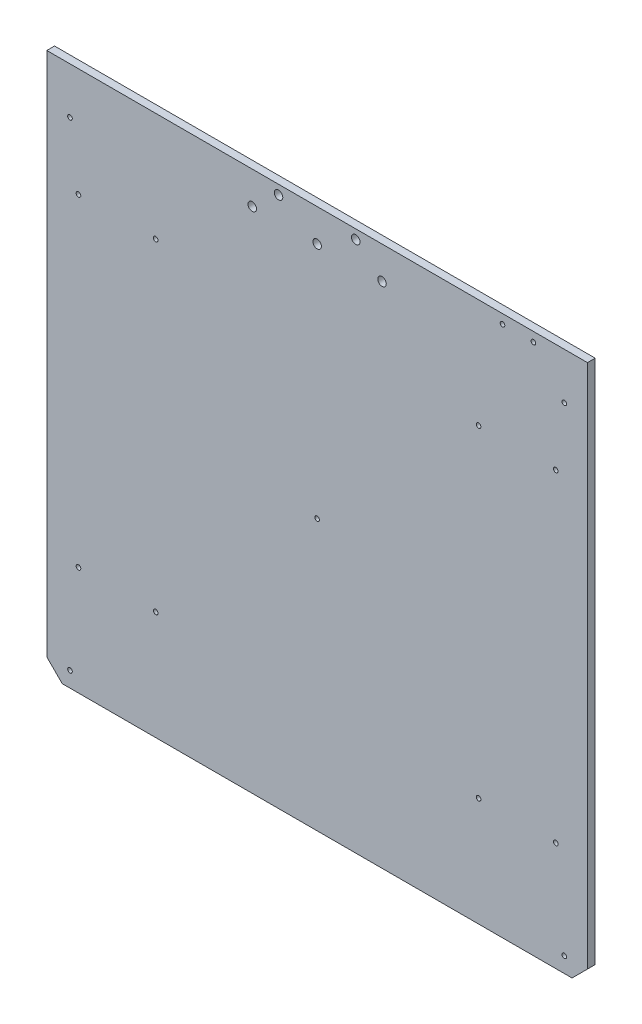
ISO-10303-21;
HEADER;
FILE_DESCRIPTION(('STEP AP214'),'2;1');
FILE_NAME('part.step','',(''),(''),'','','');
FILE_SCHEMA(('AUTOMOTIVE_DESIGN { 1 0 10303 214 1 1 1 1 }'));
ENDSEC;
DATA;
#1=APPLICATION_CONTEXT('core data for automotive mechanical design processes');
#2=APPLICATION_PROTOCOL_DEFINITION('international standard','automotive_design',2000,#1);
#3=PRODUCT_CONTEXT('',#1,'mechanical');
#4=PRODUCT('Part','Part','',(#3));
#5=PRODUCT_RELATED_PRODUCT_CATEGORY('part','',(#4));
#6=PRODUCT_DEFINITION_FORMATION('','',#4);
#7=PRODUCT_DEFINITION_CONTEXT('part definition',#1,'design');
#8=PRODUCT_DEFINITION('design','',#6,#7);
#9=PRODUCT_DEFINITION_SHAPE('','',#8);
#10=(LENGTH_UNIT() NAMED_UNIT(*) SI_UNIT(.MILLI.,.METRE.));
#11=(NAMED_UNIT(*) PLANE_ANGLE_UNIT() SI_UNIT($,.RADIAN.));
#12=(NAMED_UNIT(*) SI_UNIT($,.STERADIAN.) SOLID_ANGLE_UNIT());
#13=UNCERTAINTY_MEASURE_WITH_UNIT(LENGTH_MEASURE(1.E-05),#10,'distance_accuracy_value','');
#14=(GEOMETRIC_REPRESENTATION_CONTEXT(3) GLOBAL_UNCERTAINTY_ASSIGNED_CONTEXT((#13)) GLOBAL_UNIT_ASSIGNED_CONTEXT((#10,
#11,#12)) REPRESENTATION_CONTEXT('',''));
#15=CARTESIAN_POINT('',(0.,0.,0.));
#16=DIRECTION('',(0.,0.,1.));
#17=DIRECTION('',(1.,0.,0.));
#18=AXIS2_PLACEMENT_3D('',#15,#16,#17);
#19=CARTESIAN_POINT('',(350.,10.,-5.));
#20=DIRECTION('',(1.,0.,0.));
#21=DIRECTION('',(0.,0.,-1.));
#22=AXIS2_PLACEMENT_3D('',#19,#20,#21);
#23=PLANE('',#22);
#24=DIRECTION('',(0.,1.,0.));
#25=VECTOR('',#24,1.);
#26=CARTESIAN_POINT('',(350.,10.,0.));
#27=LINE('',#26,#25);
#28=CARTESIAN_POINT('',(350.,10.,0.));
#29=VERTEX_POINT('',#28);
#30=CARTESIAN_POINT('',(350.,350.,0.));
#31=VERTEX_POINT('',#30);
#32=EDGE_CURVE('E118',#29,#31,#27,.T.);
#33=ORIENTED_EDGE('',*,*,#32,.F.);
#34=DIRECTION('',(0.,0.,1.));
#35=VECTOR('',#34,1.);
#36=CARTESIAN_POINT('',(350.,10.,-5.));
#37=LINE('',#36,#35);
#38=CARTESIAN_POINT('',(350.,10.,-5.));
#39=VERTEX_POINT('',#38);
#40=EDGE_CURVE('E11',#39,#29,#37,.T.);
#41=ORIENTED_EDGE('',*,*,#40,.F.);
#42=DIRECTION('',(0.,1.,0.));
#43=VECTOR('',#42,1.);
#44=CARTESIAN_POINT('',(350.,10.,-5.));
#45=LINE('',#44,#43);
#46=CARTESIAN_POINT('',(350.,350.,-5.));
#47=VERTEX_POINT('',#46);
#48=EDGE_CURVE('E133',#39,#47,#45,.T.);
#49=ORIENTED_EDGE('',*,*,#48,.T.);
#50=DIRECTION('',(0.,0.,1.));
#51=VECTOR('',#50,1.);
#52=CARTESIAN_POINT('',(350.,350.,-5.));
#53=LINE('',#52,#51);
#54=EDGE_CURVE('E36',#47,#31,#53,.T.);
#55=ORIENTED_EDGE('',*,*,#54,.T.);
#56=EDGE_LOOP('',(#33,#41,#49,#55));
#57=FACE_BOUND('',#56,.T.);
#58=ADVANCED_FACE('F33',(#57),#23,.T.);
#59=CARTESIAN_POINT('',(340.,0.,-5.));
#60=DIRECTION('',(0.707106781186547,-0.707106781186548,0.));
#61=DIRECTION('',(0.707106781186548,0.707106781186547,0.));
#62=AXIS2_PLACEMENT_3D('',#59,#60,#61);
#63=PLANE('',#62);
#64=DIRECTION('',(0.707106781186548,0.707106781186547,0.));
#65=VECTOR('',#64,1.);
#66=CARTESIAN_POINT('',(340.,0.,0.));
#67=LINE('',#66,#65);
#68=CARTESIAN_POINT('',(340.,0.,0.));
#69=VERTEX_POINT('',#68);
#70=EDGE_CURVE('E131',#69,#29,#67,.T.);
#71=ORIENTED_EDGE('',*,*,#70,.F.);
#72=DIRECTION('',(0.,0.,1.));
#73=VECTOR('',#72,1.);
#74=CARTESIAN_POINT('',(340.,0.,-5.));
#75=LINE('',#74,#73);
#76=CARTESIAN_POINT('',(340.,0.,-5.));
#77=VERTEX_POINT('',#76);
#78=EDGE_CURVE('E42',#77,#69,#75,.T.);
#79=ORIENTED_EDGE('',*,*,#78,.F.);
#80=DIRECTION('',(0.707106781186548,0.707106781186547,0.));
#81=VECTOR('',#80,1.);
#82=CARTESIAN_POINT('',(340.,0.,-5.));
#83=LINE('',#82,#81);
#84=EDGE_CURVE('E108',#77,#39,#83,.T.);
#85=ORIENTED_EDGE('',*,*,#84,.T.);
#86=ORIENTED_EDGE('',*,*,#40,.T.);
#87=EDGE_LOOP('',(#71,#79,#85,#86));
#88=FACE_BOUND('',#87,.T.);
#89=ADVANCED_FACE('F141',(#88),#63,.T.);
#90=CARTESIAN_POINT('',(10.,0.,-5.));
#91=DIRECTION('',(0.,-1.,0.));
#92=DIRECTION('',(0.,0.,-1.));
#93=AXIS2_PLACEMENT_3D('',#90,#91,#92);
#94=PLANE('',#93);
#95=DIRECTION('',(1.,0.,0.));
#96=VECTOR('',#95,1.);
#97=CARTESIAN_POINT('',(10.,0.,0.));
#98=LINE('',#97,#96);
#99=CARTESIAN_POINT('',(10.,0.,0.));
#100=VERTEX_POINT('',#99);
#101=EDGE_CURVE('E95',#100,#69,#98,.T.);
#102=ORIENTED_EDGE('',*,*,#101,.F.);
#103=DIRECTION('',(0.,0.,1.));
#104=VECTOR('',#103,1.);
#105=CARTESIAN_POINT('',(10.,0.,-5.));
#106=LINE('',#105,#104);
#107=CARTESIAN_POINT('',(10.,0.,-5.));
#108=VERTEX_POINT('',#107);
#109=EDGE_CURVE('E90',#108,#100,#106,.T.);
#110=ORIENTED_EDGE('',*,*,#109,.F.);
#111=DIRECTION('',(1.,0.,0.));
#112=VECTOR('',#111,1.);
#113=CARTESIAN_POINT('',(10.,0.,-5.));
#114=LINE('',#113,#112);
#115=EDGE_CURVE('E93',#108,#77,#114,.T.);
#116=ORIENTED_EDGE('',*,*,#115,.T.);
#117=ORIENTED_EDGE('',*,*,#78,.T.);
#118=EDGE_LOOP('',(#102,#110,#116,#117));
#119=FACE_BOUND('',#118,.T.);
#120=ADVANCED_FACE('F92',(#119),#94,.T.);
#121=CARTESIAN_POINT('',(10.,0.,-5.));
#122=DIRECTION('',(-0.707106781186548,-0.707106781186548,0.));
#123=DIRECTION('',(0.707106781186548,-0.707106781186548,0.));
#124=AXIS2_PLACEMENT_3D('',#121,#122,#123);
#125=PLANE('',#124);
#126=DIRECTION('',(0.707106781186548,-0.707106781186548,0.));
#127=VECTOR('',#126,1.);
#128=CARTESIAN_POINT('',(10.,0.,0.));
#129=LINE('',#128,#127);
#130=CARTESIAN_POINT('',(0.,10.,0.));
#131=VERTEX_POINT('',#130);
#132=EDGE_CURVE('E128',#131,#100,#129,.T.);
#133=ORIENTED_EDGE('',*,*,#132,.F.);
#134=DIRECTION('',(0.,0.,1.));
#135=VECTOR('',#134,1.);
#136=CARTESIAN_POINT('',(0.,10.,-5.));
#137=LINE('',#136,#135);
#138=CARTESIAN_POINT('',(0.,10.,-5.));
#139=VERTEX_POINT('',#138);
#140=EDGE_CURVE('E100',#139,#131,#137,.T.);
#141=ORIENTED_EDGE('',*,*,#140,.F.);
#142=DIRECTION('',(0.707106781186548,-0.707106781186548,0.));
#143=VECTOR('',#142,1.);
#144=CARTESIAN_POINT('',(10.,0.,-5.));
#145=LINE('',#144,#143);
#146=EDGE_CURVE('E106',#139,#108,#145,.T.);
#147=ORIENTED_EDGE('',*,*,#146,.T.);
#148=ORIENTED_EDGE('',*,*,#109,.T.);
#149=EDGE_LOOP('',(#133,#141,#147,#148));
#150=FACE_BOUND('',#149,.T.);
#151=ADVANCED_FACE('F110',(#150),#125,.T.);
#152=CARTESIAN_POINT('',(0.,10.,-5.));
#153=DIRECTION('',(-1.,0.,0.));
#154=DIRECTION('',(0.,0.,1.));
#155=AXIS2_PLACEMENT_3D('',#152,#153,#154);
#156=PLANE('',#155);
#157=DIRECTION('',(0.,-1.,0.));
#158=VECTOR('',#157,1.);
#159=CARTESIAN_POINT('',(0.,10.,0.));
#160=LINE('',#159,#158);
#161=CARTESIAN_POINT('',(0.,350.,0.));
#162=VERTEX_POINT('',#161);
#163=EDGE_CURVE('E125',#162,#131,#160,.T.);
#164=ORIENTED_EDGE('',*,*,#163,.F.);
#165=DIRECTION('',(0.,0.,1.));
#166=VECTOR('',#165,1.);
#167=CARTESIAN_POINT('',(0.,350.,-5.));
#168=LINE('',#167,#166);
#169=CARTESIAN_POINT('',(0.,350.,-5.));
#170=VERTEX_POINT('',#169);
#171=EDGE_CURVE('E136',#170,#162,#168,.T.);
#172=ORIENTED_EDGE('',*,*,#171,.F.);
#173=DIRECTION('',(0.,-1.,0.));
#174=VECTOR('',#173,1.);
#175=CARTESIAN_POINT('',(0.,10.,-5.));
#176=LINE('',#175,#174);
#177=EDGE_CURVE('E111',#170,#139,#176,.T.);
#178=ORIENTED_EDGE('',*,*,#177,.T.);
#179=ORIENTED_EDGE('',*,*,#140,.T.);
#180=EDGE_LOOP('',(#164,#172,#178,#179));
#181=FACE_BOUND('',#180,.T.);
#182=ADVANCED_FACE('F154',(#181),#156,.T.);
#183=CARTESIAN_POINT('',(0.,350.,-5.));
#184=DIRECTION('',(0.,1.,0.));
#185=DIRECTION('',(0.,0.,1.));
#186=AXIS2_PLACEMENT_3D('',#183,#184,#185);
#187=PLANE('',#186);
#188=DIRECTION('',(-1.,0.,0.));
#189=VECTOR('',#188,1.);
#190=CARTESIAN_POINT('',(0.,350.,0.));
#191=LINE('',#190,#189);
#192=EDGE_CURVE('E121',#31,#162,#191,.T.);
#193=ORIENTED_EDGE('',*,*,#192,.F.);
#194=ORIENTED_EDGE('',*,*,#54,.F.);
#195=DIRECTION('',(-1.,0.,0.));
#196=VECTOR('',#195,1.);
#197=CARTESIAN_POINT('',(0.,350.,-5.));
#198=LINE('',#197,#196);
#199=EDGE_CURVE('E113',#47,#170,#198,.T.);
#200=ORIENTED_EDGE('',*,*,#199,.T.);
#201=ORIENTED_EDGE('',*,*,#171,.T.);
#202=EDGE_LOOP('',(#193,#194,#200,#201));
#203=FACE_BOUND('',#202,.T.);
#204=ADVANCED_FACE('F138',(#203),#187,.T.);
#205=CARTESIAN_POINT('',(0.,0.,-5.));
#206=DIRECTION('',(0.,0.,-1.));
#207=DIRECTION('',(-1.,0.,0.));
#208=AXIS2_PLACEMENT_3D('',#205,#206,#207);
#209=PLANE('',#208);
#210=CARTESIAN_POINT('',(315.,344.,-5.));
#211=DIRECTION('',(0.,0.,1.));
#212=DIRECTION('',(1.,0.,0.));
#213=AXIS2_PLACEMENT_3D('',#210,#211,#212);
#214=CIRCLE('',#213,1.49999999999997);
#215=CARTESIAN_POINT('',(316.5,344.,-5.));
#216=VERTEX_POINT('',#215);
#217=EDGE_CURVE('E252',#216,#216,#214,.T.);
#218=ORIENTED_EDGE('',*,*,#217,.T.);
#219=EDGE_LOOP('',(#218));
#220=FACE_BOUND('',#219,.T.);
#221=CARTESIAN_POINT('',(295.,344.,-5.));
#222=DIRECTION('',(0.,0.,1.));
#223=DIRECTION('',(1.,0.,0.));
#224=AXIS2_PLACEMENT_3D('',#221,#222,#223);
#225=CIRCLE('',#224,1.49999999999997);
#226=CARTESIAN_POINT('',(296.5,344.,-5.));
#227=VERTEX_POINT('',#226);
#228=EDGE_CURVE('E260',#227,#227,#225,.T.);
#229=ORIENTED_EDGE('',*,*,#228,.T.);
#230=EDGE_LOOP('',(#229));
#231=FACE_BOUND('',#230,.T.);
#232=CARTESIAN_POINT('',(335.000000000004,319.999999999997,-5.));
#233=DIRECTION('',(0.,0.,1.));
#234=DIRECTION('',(1.,0.,0.));
#235=AXIS2_PLACEMENT_3D('',#232,#233,#234);
#236=CIRCLE('',#235,1.49999999999997);
#237=CARTESIAN_POINT('',(336.500000000004,319.999999999997,-5.));
#238=VERTEX_POINT('',#237);
#239=EDGE_CURVE('E266',#238,#238,#236,.T.);
#240=ORIENTED_EDGE('',*,*,#239,.T.);
#241=EDGE_LOOP('',(#240));
#242=FACE_BOUND('',#241,.T.);
#243=CARTESIAN_POINT('',(329.5,279.5,-5.));
#244=DIRECTION('',(0.,0.,1.));
#245=DIRECTION('',(1.,0.,0.));
#246=AXIS2_PLACEMENT_3D('',#243,#244,#245);
#247=CIRCLE('',#246,1.49999999999997);
#248=CARTESIAN_POINT('',(331.,279.5,-5.));
#249=VERTEX_POINT('',#248);
#250=EDGE_CURVE('E272',#249,#249,#247,.T.);
#251=ORIENTED_EDGE('',*,*,#250,.T.);
#252=EDGE_LOOP('',(#251));
#253=FACE_BOUND('',#252,.T.);
#254=CARTESIAN_POINT('',(279.5,279.5,-5.));
#255=DIRECTION('',(0.,0.,1.));
#256=DIRECTION('',(1.,0.,0.));
#257=AXIS2_PLACEMENT_3D('',#254,#255,#256);
#258=CIRCLE('',#257,1.49999999999997);
#259=CARTESIAN_POINT('',(281.,279.5,-5.));
#260=VERTEX_POINT('',#259);
#261=EDGE_CURVE('E278',#260,#260,#258,.T.);
#262=ORIENTED_EDGE('',*,*,#261,.T.);
#263=EDGE_LOOP('',(#262));
#264=FACE_BOUND('',#263,.T.);
#265=CARTESIAN_POINT('',(15.,10.,-5.));
#266=DIRECTION('',(0.,0.,1.));
#267=DIRECTION('',(1.,0.,0.));
#268=AXIS2_PLACEMENT_3D('',#265,#266,#267);
#269=CIRCLE('',#268,1.49999999999997);
#270=CARTESIAN_POINT('',(16.5,10.,-5.));
#271=VERTEX_POINT('',#270);
#272=EDGE_CURVE('E284',#271,#271,#269,.T.);
#273=ORIENTED_EDGE('',*,*,#272,.T.);
#274=EDGE_LOOP('',(#273));
#275=FACE_BOUND('',#274,.T.);
#276=CARTESIAN_POINT('',(335.,10.,-5.));
#277=DIRECTION('',(0.,0.,1.));
#278=DIRECTION('',(1.,0.,0.));
#279=AXIS2_PLACEMENT_3D('',#276,#277,#278);
#280=CIRCLE('',#279,1.49999999999997);
#281=CARTESIAN_POINT('',(336.5,10.,-5.));
#282=VERTEX_POINT('',#281);
#283=EDGE_CURVE('E290',#282,#282,#280,.T.);
#284=ORIENTED_EDGE('',*,*,#283,.T.);
#285=EDGE_LOOP('',(#284));
#286=FACE_BOUND('',#285,.T.);
#287=CARTESIAN_POINT('',(329.5,70.5,-5.));
#288=DIRECTION('',(0.,0.,1.));
#289=DIRECTION('',(1.,0.,0.));
#290=AXIS2_PLACEMENT_3D('',#287,#288,#289);
#291=CIRCLE('',#290,1.49999999999997);
#292=CARTESIAN_POINT('',(331.,70.5,-5.));
#293=VERTEX_POINT('',#292);
#294=EDGE_CURVE('E296',#293,#293,#291,.T.);
#295=ORIENTED_EDGE('',*,*,#294,.T.);
#296=EDGE_LOOP('',(#295));
#297=FACE_BOUND('',#296,.T.);
#298=CARTESIAN_POINT('',(279.500000000001,70.5000000000011,-5.));
#299=DIRECTION('',(0.,0.,1.));
#300=DIRECTION('',(1.,0.,0.));
#301=AXIS2_PLACEMENT_3D('',#298,#299,#300);
#302=CIRCLE('',#301,1.49999999999997);
#303=CARTESIAN_POINT('',(281.000000000001,70.5000000000011,-5.));
#304=VERTEX_POINT('',#303);
#305=EDGE_CURVE('E302',#304,#304,#302,.T.);
#306=ORIENTED_EDGE('',*,*,#305,.T.);
#307=EDGE_LOOP('',(#306));
#308=FACE_BOUND('',#307,.T.);
#309=CARTESIAN_POINT('',(70.5000000000022,70.5000000000007,-5.));
#310=DIRECTION('',(0.,0.,1.));
#311=DIRECTION('',(1.,0.,0.));
#312=AXIS2_PLACEMENT_3D('',#309,#310,#311);
#313=CIRCLE('',#312,1.5);
#314=CARTESIAN_POINT('',(72.0000000000022,70.5000000000007,-5.));
#315=VERTEX_POINT('',#314);
#316=EDGE_CURVE('E308',#315,#315,#313,.T.);
#317=ORIENTED_EDGE('',*,*,#316,.T.);
#318=EDGE_LOOP('',(#317));
#319=FACE_BOUND('',#318,.T.);
#320=CARTESIAN_POINT('',(20.5,70.5,-5.));
#321=DIRECTION('',(0.,0.,1.));
#322=DIRECTION('',(1.,0.,0.));
#323=AXIS2_PLACEMENT_3D('',#320,#321,#322);
#324=CIRCLE('',#323,1.5);
#325=CARTESIAN_POINT('',(22.,70.5,-5.));
#326=VERTEX_POINT('',#325);
#327=EDGE_CURVE('E314',#326,#326,#324,.T.);
#328=ORIENTED_EDGE('',*,*,#327,.T.);
#329=EDGE_LOOP('',(#328));
#330=FACE_BOUND('',#329,.T.);
#331=CARTESIAN_POINT('',(175.000000000001,175.,-5.));
#332=DIRECTION('',(0.,0.,1.));
#333=DIRECTION('',(1.,0.,0.));
#334=AXIS2_PLACEMENT_3D('',#331,#332,#333);
#335=CIRCLE('',#334,1.5);
#336=CARTESIAN_POINT('',(176.500000000001,175.,-5.));
#337=VERTEX_POINT('',#336);
#338=EDGE_CURVE('E320',#337,#337,#335,.T.);
#339=ORIENTED_EDGE('',*,*,#338,.T.);
#340=EDGE_LOOP('',(#339));
#341=FACE_BOUND('',#340,.T.);
#342=CARTESIAN_POINT('',(70.5000000000026,279.5,-5.));
#343=DIRECTION('',(0.,0.,1.));
#344=DIRECTION('',(1.,0.,0.));
#345=AXIS2_PLACEMENT_3D('',#342,#343,#344);
#346=CIRCLE('',#345,1.5);
#347=CARTESIAN_POINT('',(72.0000000000026,279.5,-5.));
#348=VERTEX_POINT('',#347);
#349=EDGE_CURVE('E326',#348,#348,#346,.T.);
#350=ORIENTED_EDGE('',*,*,#349,.T.);
#351=EDGE_LOOP('',(#350));
#352=FACE_BOUND('',#351,.T.);
#353=CARTESIAN_POINT('',(20.5,279.5,-5.));
#354=DIRECTION('',(0.,0.,1.));
#355=DIRECTION('',(1.,0.,0.));
#356=AXIS2_PLACEMENT_3D('',#353,#354,#355);
#357=CIRCLE('',#356,1.5);
#358=CARTESIAN_POINT('',(22.,279.5,-5.));
#359=VERTEX_POINT('',#358);
#360=EDGE_CURVE('E332',#359,#359,#357,.T.);
#361=ORIENTED_EDGE('',*,*,#360,.T.);
#362=EDGE_LOOP('',(#361));
#363=FACE_BOUND('',#362,.T.);
#364=CARTESIAN_POINT('',(15.,320.,-5.));
#365=DIRECTION('',(0.,0.,1.));
#366=DIRECTION('',(1.,0.,0.));
#367=AXIS2_PLACEMENT_3D('',#364,#365,#366);
#368=CIRCLE('',#367,1.5);
#369=CARTESIAN_POINT('',(16.5,320.,-5.));
#370=VERTEX_POINT('',#369);
#371=EDGE_CURVE('E338',#370,#370,#368,.T.);
#372=ORIENTED_EDGE('',*,*,#371,.T.);
#373=EDGE_LOOP('',(#372));
#374=FACE_BOUND('',#373,.T.);
#375=CARTESIAN_POINT('',(133.,329.,-5.));
#376=DIRECTION('',(0.,0.,1.));
#377=DIRECTION('',(-1.,0.,0.));
#378=AXIS2_PLACEMENT_3D('',#375,#376,#377);
#379=CIRCLE('',#378,2.75000000000001);
#380=CARTESIAN_POINT('',(130.25,329.,-5.));
#381=VERTEX_POINT('',#380);
#382=EDGE_CURVE('E344',#381,#381,#379,.T.);
#383=ORIENTED_EDGE('',*,*,#382,.T.);
#384=EDGE_LOOP('',(#383));
#385=FACE_BOUND('',#384,.T.);
#386=CARTESIAN_POINT('',(217.,329.,-5.));
#387=DIRECTION('',(0.,0.,1.));
#388=DIRECTION('',(1.,0.,0.));
#389=AXIS2_PLACEMENT_3D('',#386,#387,#388);
#390=CIRCLE('',#389,2.75000000000001);
#391=CARTESIAN_POINT('',(219.75,329.,-5.));
#392=VERTEX_POINT('',#391);
#393=EDGE_CURVE('E350',#392,#392,#390,.T.);
#394=ORIENTED_EDGE('',*,*,#393,.T.);
#395=EDGE_LOOP('',(#394));
#396=FACE_BOUND('',#395,.T.);
#397=CARTESIAN_POINT('',(175.,329.,-5.));
#398=DIRECTION('',(0.,0.,1.));
#399=DIRECTION('',(1.,0.,0.));
#400=AXIS2_PLACEMENT_3D('',#397,#398,#399);
#401=CIRCLE('',#400,2.75000000000001);
#402=CARTESIAN_POINT('',(177.75,329.,-5.));
#403=VERTEX_POINT('',#402);
#404=EDGE_CURVE('E356',#403,#403,#401,.T.);
#405=ORIENTED_EDGE('',*,*,#404,.T.);
#406=EDGE_LOOP('',(#405));
#407=FACE_BOUND('',#406,.T.);
#408=CARTESIAN_POINT('',(150.,344.,-5.));
#409=DIRECTION('',(0.,0.,1.));
#410=DIRECTION('',(-1.,0.,0.));
#411=AXIS2_PLACEMENT_3D('',#408,#409,#410);
#412=CIRCLE('',#411,2.75000000000001);
#413=CARTESIAN_POINT('',(147.25,344.,-5.));
#414=VERTEX_POINT('',#413);
#415=EDGE_CURVE('E362',#414,#414,#412,.T.);
#416=ORIENTED_EDGE('',*,*,#415,.T.);
#417=EDGE_LOOP('',(#416));
#418=FACE_BOUND('',#417,.T.);
#419=CARTESIAN_POINT('',(200.,344.,-5.));
#420=DIRECTION('',(0.,0.,1.));
#421=DIRECTION('',(1.,0.,0.));
#422=AXIS2_PLACEMENT_3D('',#419,#420,#421);
#423=CIRCLE('',#422,2.75000000000001);
#424=CARTESIAN_POINT('',(202.75,344.,-5.));
#425=VERTEX_POINT('',#424);
#426=EDGE_CURVE('E122',#425,#425,#423,.T.);
#427=ORIENTED_EDGE('',*,*,#426,.T.);
#428=EDGE_LOOP('',(#427));
#429=FACE_BOUND('',#428,.T.);
#430=ORIENTED_EDGE('',*,*,#48,.F.);
#431=ORIENTED_EDGE('',*,*,#84,.F.);
#432=ORIENTED_EDGE('',*,*,#115,.F.);
#433=ORIENTED_EDGE('',*,*,#146,.F.);
#434=ORIENTED_EDGE('',*,*,#177,.F.);
#435=ORIENTED_EDGE('',*,*,#199,.F.);
#436=EDGE_LOOP('',(#430,#431,#432,#433,#434,#435));
#437=FACE_BOUND('',#436,.T.);
#438=ADVANCED_FACE('F104',(#220,#231,#242,#253,#264,#275,#286,#297,#308,#319,#330,#341,#352,
#363,#374,#385,#396,#407,#418,#429,#437),#209,.T.);
#439=CARTESIAN_POINT('',(0.,0.,0.));
#440=DIRECTION('',(0.,0.,-1.));
#441=DIRECTION('',(-1.,0.,0.));
#442=AXIS2_PLACEMENT_3D('',#439,#440,#441);
#443=PLANE('',#442);
#444=CARTESIAN_POINT('',(315.,344.,0.));
#445=DIRECTION('',(0.,0.,1.));
#446=DIRECTION('',(1.,0.,0.));
#447=AXIS2_PLACEMENT_3D('',#444,#445,#446);
#448=CIRCLE('',#447,1.49999999999997);
#449=CARTESIAN_POINT('',(316.5,344.,0.));
#450=VERTEX_POINT('',#449);
#451=EDGE_CURVE('E255',#450,#450,#448,.T.);
#452=ORIENTED_EDGE('',*,*,#451,.F.);
#453=EDGE_LOOP('',(#452));
#454=FACE_BOUND('',#453,.T.);
#455=CARTESIAN_POINT('',(295.,344.,0.));
#456=DIRECTION('',(0.,0.,1.));
#457=DIRECTION('',(1.,0.,0.));
#458=AXIS2_PLACEMENT_3D('',#455,#456,#457);
#459=CIRCLE('',#458,1.49999999999997);
#460=CARTESIAN_POINT('',(296.5,344.,0.));
#461=VERTEX_POINT('',#460);
#462=EDGE_CURVE('E257',#461,#461,#459,.T.);
#463=ORIENTED_EDGE('',*,*,#462,.F.);
#464=EDGE_LOOP('',(#463));
#465=FACE_BOUND('',#464,.T.);
#466=CARTESIAN_POINT('',(335.000000000004,319.999999999997,0.));
#467=DIRECTION('',(0.,0.,1.));
#468=DIRECTION('',(1.,0.,0.));
#469=AXIS2_PLACEMENT_3D('',#466,#467,#468);
#470=CIRCLE('',#469,1.49999999999997);
#471=CARTESIAN_POINT('',(336.500000000004,319.999999999997,0.));
#472=VERTEX_POINT('',#471);
#473=EDGE_CURVE('E263',#472,#472,#470,.T.);
#474=ORIENTED_EDGE('',*,*,#473,.F.);
#475=EDGE_LOOP('',(#474));
#476=FACE_BOUND('',#475,.T.);
#477=CARTESIAN_POINT('',(329.5,279.5,0.));
#478=DIRECTION('',(0.,0.,1.));
#479=DIRECTION('',(1.,0.,0.));
#480=AXIS2_PLACEMENT_3D('',#477,#478,#479);
#481=CIRCLE('',#480,1.49999999999997);
#482=CARTESIAN_POINT('',(331.,279.5,0.));
#483=VERTEX_POINT('',#482);
#484=EDGE_CURVE('E269',#483,#483,#481,.T.);
#485=ORIENTED_EDGE('',*,*,#484,.F.);
#486=EDGE_LOOP('',(#485));
#487=FACE_BOUND('',#486,.T.);
#488=CARTESIAN_POINT('',(279.5,279.5,0.));
#489=DIRECTION('',(0.,0.,1.));
#490=DIRECTION('',(1.,0.,0.));
#491=AXIS2_PLACEMENT_3D('',#488,#489,#490);
#492=CIRCLE('',#491,1.49999999999997);
#493=CARTESIAN_POINT('',(281.,279.5,0.));
#494=VERTEX_POINT('',#493);
#495=EDGE_CURVE('E275',#494,#494,#492,.T.);
#496=ORIENTED_EDGE('',*,*,#495,.F.);
#497=EDGE_LOOP('',(#496));
#498=FACE_BOUND('',#497,.T.);
#499=CARTESIAN_POINT('',(15.,10.,0.));
#500=DIRECTION('',(0.,0.,1.));
#501=DIRECTION('',(1.,0.,0.));
#502=AXIS2_PLACEMENT_3D('',#499,#500,#501);
#503=CIRCLE('',#502,1.49999999999997);
#504=CARTESIAN_POINT('',(16.5,10.,0.));
#505=VERTEX_POINT('',#504);
#506=EDGE_CURVE('E281',#505,#505,#503,.T.);
#507=ORIENTED_EDGE('',*,*,#506,.F.);
#508=EDGE_LOOP('',(#507));
#509=FACE_BOUND('',#508,.T.);
#510=CARTESIAN_POINT('',(335.,10.,0.));
#511=DIRECTION('',(0.,0.,1.));
#512=DIRECTION('',(1.,0.,0.));
#513=AXIS2_PLACEMENT_3D('',#510,#511,#512);
#514=CIRCLE('',#513,1.49999999999997);
#515=CARTESIAN_POINT('',(336.5,10.,0.));
#516=VERTEX_POINT('',#515);
#517=EDGE_CURVE('E287',#516,#516,#514,.T.);
#518=ORIENTED_EDGE('',*,*,#517,.F.);
#519=EDGE_LOOP('',(#518));
#520=FACE_BOUND('',#519,.T.);
#521=CARTESIAN_POINT('',(329.5,70.5,0.));
#522=DIRECTION('',(0.,0.,1.));
#523=DIRECTION('',(1.,0.,0.));
#524=AXIS2_PLACEMENT_3D('',#521,#522,#523);
#525=CIRCLE('',#524,1.49999999999997);
#526=CARTESIAN_POINT('',(331.,70.5,0.));
#527=VERTEX_POINT('',#526);
#528=EDGE_CURVE('E293',#527,#527,#525,.T.);
#529=ORIENTED_EDGE('',*,*,#528,.F.);
#530=EDGE_LOOP('',(#529));
#531=FACE_BOUND('',#530,.T.);
#532=CARTESIAN_POINT('',(279.500000000001,70.5000000000011,0.));
#533=DIRECTION('',(0.,0.,1.));
#534=DIRECTION('',(1.,0.,0.));
#535=AXIS2_PLACEMENT_3D('',#532,#533,#534);
#536=CIRCLE('',#535,1.49999999999997);
#537=CARTESIAN_POINT('',(281.000000000001,70.5000000000011,0.));
#538=VERTEX_POINT('',#537);
#539=EDGE_CURVE('E299',#538,#538,#536,.T.);
#540=ORIENTED_EDGE('',*,*,#539,.F.);
#541=EDGE_LOOP('',(#540));
#542=FACE_BOUND('',#541,.T.);
#543=CARTESIAN_POINT('',(70.5000000000022,70.5000000000007,0.));
#544=DIRECTION('',(0.,0.,1.));
#545=DIRECTION('',(1.,0.,0.));
#546=AXIS2_PLACEMENT_3D('',#543,#544,#545);
#547=CIRCLE('',#546,1.5);
#548=CARTESIAN_POINT('',(72.0000000000022,70.5000000000007,0.));
#549=VERTEX_POINT('',#548);
#550=EDGE_CURVE('E305',#549,#549,#547,.T.);
#551=ORIENTED_EDGE('',*,*,#550,.F.);
#552=EDGE_LOOP('',(#551));
#553=FACE_BOUND('',#552,.T.);
#554=CARTESIAN_POINT('',(20.5,70.5,0.));
#555=DIRECTION('',(0.,0.,1.));
#556=DIRECTION('',(1.,0.,0.));
#557=AXIS2_PLACEMENT_3D('',#554,#555,#556);
#558=CIRCLE('',#557,1.5);
#559=CARTESIAN_POINT('',(22.,70.5,0.));
#560=VERTEX_POINT('',#559);
#561=EDGE_CURVE('E311',#560,#560,#558,.T.);
#562=ORIENTED_EDGE('',*,*,#561,.F.);
#563=EDGE_LOOP('',(#562));
#564=FACE_BOUND('',#563,.T.);
#565=CARTESIAN_POINT('',(175.000000000001,175.,0.));
#566=DIRECTION('',(0.,0.,1.));
#567=DIRECTION('',(1.,0.,0.));
#568=AXIS2_PLACEMENT_3D('',#565,#566,#567);
#569=CIRCLE('',#568,1.5);
#570=CARTESIAN_POINT('',(176.500000000001,175.,0.));
#571=VERTEX_POINT('',#570);
#572=EDGE_CURVE('E317',#571,#571,#569,.T.);
#573=ORIENTED_EDGE('',*,*,#572,.F.);
#574=EDGE_LOOP('',(#573));
#575=FACE_BOUND('',#574,.T.);
#576=CARTESIAN_POINT('',(70.5000000000026,279.5,0.));
#577=DIRECTION('',(0.,0.,1.));
#578=DIRECTION('',(1.,0.,0.));
#579=AXIS2_PLACEMENT_3D('',#576,#577,#578);
#580=CIRCLE('',#579,1.5);
#581=CARTESIAN_POINT('',(72.0000000000026,279.5,0.));
#582=VERTEX_POINT('',#581);
#583=EDGE_CURVE('E323',#582,#582,#580,.T.);
#584=ORIENTED_EDGE('',*,*,#583,.F.);
#585=EDGE_LOOP('',(#584));
#586=FACE_BOUND('',#585,.T.);
#587=CARTESIAN_POINT('',(20.5,279.5,0.));
#588=DIRECTION('',(0.,0.,1.));
#589=DIRECTION('',(1.,0.,0.));
#590=AXIS2_PLACEMENT_3D('',#587,#588,#589);
#591=CIRCLE('',#590,1.5);
#592=CARTESIAN_POINT('',(22.,279.5,0.));
#593=VERTEX_POINT('',#592);
#594=EDGE_CURVE('E329',#593,#593,#591,.T.);
#595=ORIENTED_EDGE('',*,*,#594,.F.);
#596=EDGE_LOOP('',(#595));
#597=FACE_BOUND('',#596,.T.);
#598=CARTESIAN_POINT('',(15.,320.,0.));
#599=DIRECTION('',(0.,0.,1.));
#600=DIRECTION('',(1.,0.,0.));
#601=AXIS2_PLACEMENT_3D('',#598,#599,#600);
#602=CIRCLE('',#601,1.5);
#603=CARTESIAN_POINT('',(16.5,320.,0.));
#604=VERTEX_POINT('',#603);
#605=EDGE_CURVE('E335',#604,#604,#602,.T.);
#606=ORIENTED_EDGE('',*,*,#605,.F.);
#607=EDGE_LOOP('',(#606));
#608=FACE_BOUND('',#607,.T.);
#609=CARTESIAN_POINT('',(133.,329.,0.));
#610=DIRECTION('',(0.,0.,1.));
#611=DIRECTION('',(-1.,0.,0.));
#612=AXIS2_PLACEMENT_3D('',#609,#610,#611);
#613=CIRCLE('',#612,2.75000000000001);
#614=CARTESIAN_POINT('',(130.25,329.,0.));
#615=VERTEX_POINT('',#614);
#616=EDGE_CURVE('E341',#615,#615,#613,.T.);
#617=ORIENTED_EDGE('',*,*,#616,.F.);
#618=EDGE_LOOP('',(#617));
#619=FACE_BOUND('',#618,.T.);
#620=CARTESIAN_POINT('',(217.,329.,0.));
#621=DIRECTION('',(0.,0.,1.));
#622=DIRECTION('',(1.,0.,0.));
#623=AXIS2_PLACEMENT_3D('',#620,#621,#622);
#624=CIRCLE('',#623,2.75000000000001);
#625=CARTESIAN_POINT('',(219.75,329.,0.));
#626=VERTEX_POINT('',#625);
#627=EDGE_CURVE('E347',#626,#626,#624,.T.);
#628=ORIENTED_EDGE('',*,*,#627,.F.);
#629=EDGE_LOOP('',(#628));
#630=FACE_BOUND('',#629,.T.);
#631=CARTESIAN_POINT('',(175.,329.,0.));
#632=DIRECTION('',(0.,0.,1.));
#633=DIRECTION('',(1.,0.,0.));
#634=AXIS2_PLACEMENT_3D('',#631,#632,#633);
#635=CIRCLE('',#634,2.75000000000001);
#636=CARTESIAN_POINT('',(177.75,329.,0.));
#637=VERTEX_POINT('',#636);
#638=EDGE_CURVE('E353',#637,#637,#635,.T.);
#639=ORIENTED_EDGE('',*,*,#638,.F.);
#640=EDGE_LOOP('',(#639));
#641=FACE_BOUND('',#640,.T.);
#642=CARTESIAN_POINT('',(150.,344.,0.));
#643=DIRECTION('',(0.,0.,1.));
#644=DIRECTION('',(-1.,0.,0.));
#645=AXIS2_PLACEMENT_3D('',#642,#643,#644);
#646=CIRCLE('',#645,2.75000000000001);
#647=CARTESIAN_POINT('',(147.25,344.,0.));
#648=VERTEX_POINT('',#647);
#649=EDGE_CURVE('E359',#648,#648,#646,.T.);
#650=ORIENTED_EDGE('',*,*,#649,.F.);
#651=EDGE_LOOP('',(#650));
#652=FACE_BOUND('',#651,.T.);
#653=CARTESIAN_POINT('',(200.,344.,0.));
#654=DIRECTION('',(0.,0.,1.));
#655=DIRECTION('',(1.,0.,0.));
#656=AXIS2_PLACEMENT_3D('',#653,#654,#655);
#657=CIRCLE('',#656,2.75000000000001);
#658=CARTESIAN_POINT('',(202.75,344.,0.));
#659=VERTEX_POINT('',#658);
#660=EDGE_CURVE('E365',#659,#659,#657,.T.);
#661=ORIENTED_EDGE('',*,*,#660,.F.);
#662=EDGE_LOOP('',(#661));
#663=FACE_BOUND('',#662,.T.);
#664=ORIENTED_EDGE('',*,*,#32,.T.);
#665=ORIENTED_EDGE('',*,*,#192,.T.);
#666=ORIENTED_EDGE('',*,*,#163,.T.);
#667=ORIENTED_EDGE('',*,*,#132,.T.);
#668=ORIENTED_EDGE('',*,*,#101,.T.);
#669=ORIENTED_EDGE('',*,*,#70,.T.);
#670=EDGE_LOOP('',(#664,#665,#666,#667,#668,#669));
#671=FACE_BOUND('',#670,.T.);
#672=ADVANCED_FACE('F140',(#454,#465,#476,#487,#498,#509,#520,#531,#542,#553,#564,#575,#586,
#597,#608,#619,#630,#641,#652,#663,#671),#443,.F.);
#673=CARTESIAN_POINT('',(200.,344.,-5.));
#674=DIRECTION('',(0.,0.,1.));
#675=DIRECTION('',(1.,0.,0.));
#676=AXIS2_PLACEMENT_3D('',#673,#674,#675);
#677=CYLINDRICAL_SURFACE('',#676,2.75000000000001);
#678=ORIENTED_EDGE('',*,*,#426,.F.);
#679=EDGE_LOOP('',(#678));
#680=FACE_BOUND('',#679,.T.);
#681=ORIENTED_EDGE('',*,*,#660,.T.);
#682=EDGE_LOOP('',(#681));
#683=FACE_BOUND('',#682,.T.);
#684=ADVANCED_FACE('F165',(#680,#683),#677,.F.);
#685=CARTESIAN_POINT('',(150.,344.,-5.));
#686=DIRECTION('',(0.,0.,1.));
#687=DIRECTION('',(1.,0.,0.));
#688=AXIS2_PLACEMENT_3D('',#685,#686,#687);
#689=CYLINDRICAL_SURFACE('',#688,2.75000000000001);
#690=ORIENTED_EDGE('',*,*,#415,.F.);
#691=EDGE_LOOP('',(#690));
#692=FACE_BOUND('',#691,.T.);
#693=ORIENTED_EDGE('',*,*,#649,.T.);
#694=EDGE_LOOP('',(#693));
#695=FACE_BOUND('',#694,.T.);
#696=ADVANCED_FACE('F172',(#692,#695),#689,.F.);
#697=CARTESIAN_POINT('',(175.,329.,-5.));
#698=DIRECTION('',(0.,0.,1.));
#699=DIRECTION('',(1.,0.,0.));
#700=AXIS2_PLACEMENT_3D('',#697,#698,#699);
#701=CYLINDRICAL_SURFACE('',#700,2.75000000000001);
#702=ORIENTED_EDGE('',*,*,#404,.F.);
#703=EDGE_LOOP('',(#702));
#704=FACE_BOUND('',#703,.T.);
#705=ORIENTED_EDGE('',*,*,#638,.T.);
#706=EDGE_LOOP('',(#705));
#707=FACE_BOUND('',#706,.T.);
#708=ADVANCED_FACE('F176',(#704,#707),#701,.F.);
#709=CARTESIAN_POINT('',(217.,329.,-5.));
#710=DIRECTION('',(0.,0.,1.));
#711=DIRECTION('',(1.,0.,0.));
#712=AXIS2_PLACEMENT_3D('',#709,#710,#711);
#713=CYLINDRICAL_SURFACE('',#712,2.75000000000001);
#714=ORIENTED_EDGE('',*,*,#393,.F.);
#715=EDGE_LOOP('',(#714));
#716=FACE_BOUND('',#715,.T.);
#717=ORIENTED_EDGE('',*,*,#627,.T.);
#718=EDGE_LOOP('',(#717));
#719=FACE_BOUND('',#718,.T.);
#720=ADVANCED_FACE('F180',(#716,#719),#713,.F.);
#721=CARTESIAN_POINT('',(133.,329.,-5.));
#722=DIRECTION('',(0.,0.,1.));
#723=DIRECTION('',(1.,0.,0.));
#724=AXIS2_PLACEMENT_3D('',#721,#722,#723);
#725=CYLINDRICAL_SURFACE('',#724,2.75000000000001);
#726=ORIENTED_EDGE('',*,*,#382,.F.);
#727=EDGE_LOOP('',(#726));
#728=FACE_BOUND('',#727,.T.);
#729=ORIENTED_EDGE('',*,*,#616,.T.);
#730=EDGE_LOOP('',(#729));
#731=FACE_BOUND('',#730,.T.);
#732=ADVANCED_FACE('F184',(#728,#731),#725,.F.);
#733=CARTESIAN_POINT('',(15.,320.,-5.));
#734=DIRECTION('',(0.,0.,1.));
#735=DIRECTION('',(1.,0.,0.));
#736=AXIS2_PLACEMENT_3D('',#733,#734,#735);
#737=CYLINDRICAL_SURFACE('',#736,1.5);
#738=ORIENTED_EDGE('',*,*,#371,.F.);
#739=EDGE_LOOP('',(#738));
#740=FACE_BOUND('',#739,.T.);
#741=ORIENTED_EDGE('',*,*,#605,.T.);
#742=EDGE_LOOP('',(#741));
#743=FACE_BOUND('',#742,.T.);
#744=ADVANCED_FACE('F188',(#740,#743),#737,.F.);
#745=CARTESIAN_POINT('',(20.5,279.5,-5.));
#746=DIRECTION('',(0.,0.,1.));
#747=DIRECTION('',(1.,0.,0.));
#748=AXIS2_PLACEMENT_3D('',#745,#746,#747);
#749=CYLINDRICAL_SURFACE('',#748,1.5);
#750=ORIENTED_EDGE('',*,*,#360,.F.);
#751=EDGE_LOOP('',(#750));
#752=FACE_BOUND('',#751,.T.);
#753=ORIENTED_EDGE('',*,*,#594,.T.);
#754=EDGE_LOOP('',(#753));
#755=FACE_BOUND('',#754,.T.);
#756=ADVANCED_FACE('F192',(#752,#755),#749,.F.);
#757=CARTESIAN_POINT('',(70.5000000000026,279.5,-5.));
#758=DIRECTION('',(0.,0.,1.));
#759=DIRECTION('',(1.,0.,0.));
#760=AXIS2_PLACEMENT_3D('',#757,#758,#759);
#761=CYLINDRICAL_SURFACE('',#760,1.5);
#762=ORIENTED_EDGE('',*,*,#349,.F.);
#763=EDGE_LOOP('',(#762));
#764=FACE_BOUND('',#763,.T.);
#765=ORIENTED_EDGE('',*,*,#583,.T.);
#766=EDGE_LOOP('',(#765));
#767=FACE_BOUND('',#766,.T.);
#768=ADVANCED_FACE('F196',(#764,#767),#761,.F.);
#769=CARTESIAN_POINT('',(175.000000000001,175.,-5.));
#770=DIRECTION('',(0.,0.,1.));
#771=DIRECTION('',(1.,0.,0.));
#772=AXIS2_PLACEMENT_3D('',#769,#770,#771);
#773=CYLINDRICAL_SURFACE('',#772,1.5);
#774=ORIENTED_EDGE('',*,*,#338,.F.);
#775=EDGE_LOOP('',(#774));
#776=FACE_BOUND('',#775,.T.);
#777=ORIENTED_EDGE('',*,*,#572,.T.);
#778=EDGE_LOOP('',(#777));
#779=FACE_BOUND('',#778,.T.);
#780=ADVANCED_FACE('F200',(#776,#779),#773,.F.);
#781=CARTESIAN_POINT('',(20.5,70.5,-5.));
#782=DIRECTION('',(0.,0.,1.));
#783=DIRECTION('',(1.,0.,0.));
#784=AXIS2_PLACEMENT_3D('',#781,#782,#783);
#785=CYLINDRICAL_SURFACE('',#784,1.5);
#786=ORIENTED_EDGE('',*,*,#327,.F.);
#787=EDGE_LOOP('',(#786));
#788=FACE_BOUND('',#787,.T.);
#789=ORIENTED_EDGE('',*,*,#561,.T.);
#790=EDGE_LOOP('',(#789));
#791=FACE_BOUND('',#790,.T.);
#792=ADVANCED_FACE('F204',(#788,#791),#785,.F.);
#793=CARTESIAN_POINT('',(70.5000000000022,70.5000000000007,-5.));
#794=DIRECTION('',(0.,0.,1.));
#795=DIRECTION('',(1.,0.,0.));
#796=AXIS2_PLACEMENT_3D('',#793,#794,#795);
#797=CYLINDRICAL_SURFACE('',#796,1.5);
#798=ORIENTED_EDGE('',*,*,#316,.F.);
#799=EDGE_LOOP('',(#798));
#800=FACE_BOUND('',#799,.T.);
#801=ORIENTED_EDGE('',*,*,#550,.T.);
#802=EDGE_LOOP('',(#801));
#803=FACE_BOUND('',#802,.T.);
#804=ADVANCED_FACE('F208',(#800,#803),#797,.F.);
#805=CARTESIAN_POINT('',(279.500000000001,70.5000000000011,-5.));
#806=DIRECTION('',(0.,0.,1.));
#807=DIRECTION('',(1.,0.,0.));
#808=AXIS2_PLACEMENT_3D('',#805,#806,#807);
#809=CYLINDRICAL_SURFACE('',#808,1.49999999999997);
#810=ORIENTED_EDGE('',*,*,#305,.F.);
#811=EDGE_LOOP('',(#810));
#812=FACE_BOUND('',#811,.T.);
#813=ORIENTED_EDGE('',*,*,#539,.T.);
#814=EDGE_LOOP('',(#813));
#815=FACE_BOUND('',#814,.T.);
#816=ADVANCED_FACE('F212',(#812,#815),#809,.F.);
#817=CARTESIAN_POINT('',(329.5,70.5,-5.));
#818=DIRECTION('',(0.,0.,1.));
#819=DIRECTION('',(1.,0.,0.));
#820=AXIS2_PLACEMENT_3D('',#817,#818,#819);
#821=CYLINDRICAL_SURFACE('',#820,1.49999999999997);
#822=ORIENTED_EDGE('',*,*,#294,.F.);
#823=EDGE_LOOP('',(#822));
#824=FACE_BOUND('',#823,.T.);
#825=ORIENTED_EDGE('',*,*,#528,.T.);
#826=EDGE_LOOP('',(#825));
#827=FACE_BOUND('',#826,.T.);
#828=ADVANCED_FACE('F216',(#824,#827),#821,.F.);
#829=CARTESIAN_POINT('',(335.,10.,-5.));
#830=DIRECTION('',(0.,0.,1.));
#831=DIRECTION('',(1.,0.,0.));
#832=AXIS2_PLACEMENT_3D('',#829,#830,#831);
#833=CYLINDRICAL_SURFACE('',#832,1.49999999999997);
#834=ORIENTED_EDGE('',*,*,#283,.F.);
#835=EDGE_LOOP('',(#834));
#836=FACE_BOUND('',#835,.T.);
#837=ORIENTED_EDGE('',*,*,#517,.T.);
#838=EDGE_LOOP('',(#837));
#839=FACE_BOUND('',#838,.T.);
#840=ADVANCED_FACE('F220',(#836,#839),#833,.F.);
#841=CARTESIAN_POINT('',(15.,10.,-5.));
#842=DIRECTION('',(0.,0.,1.));
#843=DIRECTION('',(1.,0.,0.));
#844=AXIS2_PLACEMENT_3D('',#841,#842,#843);
#845=CYLINDRICAL_SURFACE('',#844,1.49999999999997);
#846=ORIENTED_EDGE('',*,*,#272,.F.);
#847=EDGE_LOOP('',(#846));
#848=FACE_BOUND('',#847,.T.);
#849=ORIENTED_EDGE('',*,*,#506,.T.);
#850=EDGE_LOOP('',(#849));
#851=FACE_BOUND('',#850,.T.);
#852=ADVANCED_FACE('F224',(#848,#851),#845,.F.);
#853=CARTESIAN_POINT('',(279.5,279.5,-5.));
#854=DIRECTION('',(0.,0.,1.));
#855=DIRECTION('',(1.,0.,0.));
#856=AXIS2_PLACEMENT_3D('',#853,#854,#855);
#857=CYLINDRICAL_SURFACE('',#856,1.49999999999997);
#858=ORIENTED_EDGE('',*,*,#261,.F.);
#859=EDGE_LOOP('',(#858));
#860=FACE_BOUND('',#859,.T.);
#861=ORIENTED_EDGE('',*,*,#495,.T.);
#862=EDGE_LOOP('',(#861));
#863=FACE_BOUND('',#862,.T.);
#864=ADVANCED_FACE('F228',(#860,#863),#857,.F.);
#865=CARTESIAN_POINT('',(329.5,279.5,-5.));
#866=DIRECTION('',(0.,0.,1.));
#867=DIRECTION('',(1.,0.,0.));
#868=AXIS2_PLACEMENT_3D('',#865,#866,#867);
#869=CYLINDRICAL_SURFACE('',#868,1.49999999999997);
#870=ORIENTED_EDGE('',*,*,#250,.F.);
#871=EDGE_LOOP('',(#870));
#872=FACE_BOUND('',#871,.T.);
#873=ORIENTED_EDGE('',*,*,#484,.T.);
#874=EDGE_LOOP('',(#873));
#875=FACE_BOUND('',#874,.T.);
#876=ADVANCED_FACE('F232',(#872,#875),#869,.F.);
#877=CARTESIAN_POINT('',(335.000000000004,319.999999999997,-5.));
#878=DIRECTION('',(0.,0.,1.));
#879=DIRECTION('',(1.,0.,0.));
#880=AXIS2_PLACEMENT_3D('',#877,#878,#879);
#881=CYLINDRICAL_SURFACE('',#880,1.49999999999997);
#882=ORIENTED_EDGE('',*,*,#239,.F.);
#883=EDGE_LOOP('',(#882));
#884=FACE_BOUND('',#883,.T.);
#885=ORIENTED_EDGE('',*,*,#473,.T.);
#886=EDGE_LOOP('',(#885));
#887=FACE_BOUND('',#886,.T.);
#888=ADVANCED_FACE('F236',(#884,#887),#881,.F.);
#889=CARTESIAN_POINT('',(295.,344.,-5.));
#890=DIRECTION('',(0.,0.,1.));
#891=DIRECTION('',(1.,0.,0.));
#892=AXIS2_PLACEMENT_3D('',#889,#890,#891);
#893=CYLINDRICAL_SURFACE('',#892,1.49999999999997);
#894=ORIENTED_EDGE('',*,*,#228,.F.);
#895=EDGE_LOOP('',(#894));
#896=FACE_BOUND('',#895,.T.);
#897=ORIENTED_EDGE('',*,*,#462,.T.);
#898=EDGE_LOOP('',(#897));
#899=FACE_BOUND('',#898,.T.);
#900=ADVANCED_FACE('F240',(#896,#899),#893,.F.);
#901=CARTESIAN_POINT('',(315.,344.,-5.));
#902=DIRECTION('',(0.,0.,1.));
#903=DIRECTION('',(1.,0.,0.));
#904=AXIS2_PLACEMENT_3D('',#901,#902,#903);
#905=CYLINDRICAL_SURFACE('',#904,1.49999999999997);
#906=ORIENTED_EDGE('',*,*,#217,.F.);
#907=EDGE_LOOP('',(#906));
#908=FACE_BOUND('',#907,.T.);
#909=ORIENTED_EDGE('',*,*,#451,.T.);
#910=EDGE_LOOP('',(#909));
#911=FACE_BOUND('',#910,.T.);
#912=ADVANCED_FACE('F244',(#908,#911),#905,.F.);
#913=CLOSED_SHELL('',(#58,#89,#120,#151,#182,#204,#438,#672,#684,#696,#708,#720,#732,#744,#756,
#768,#780,#792,#804,#816,#828,#840,#852,#864,#876,#888,#900,#912));
#914=MANIFOLD_SOLID_BREP('B2',#913);
#915=ADVANCED_BREP_SHAPE_REPRESENTATION('',(#18,#914),#14);
#916=SHAPE_DEFINITION_REPRESENTATION(#9,#915);
ENDSEC;
END-ISO-10303-21;
